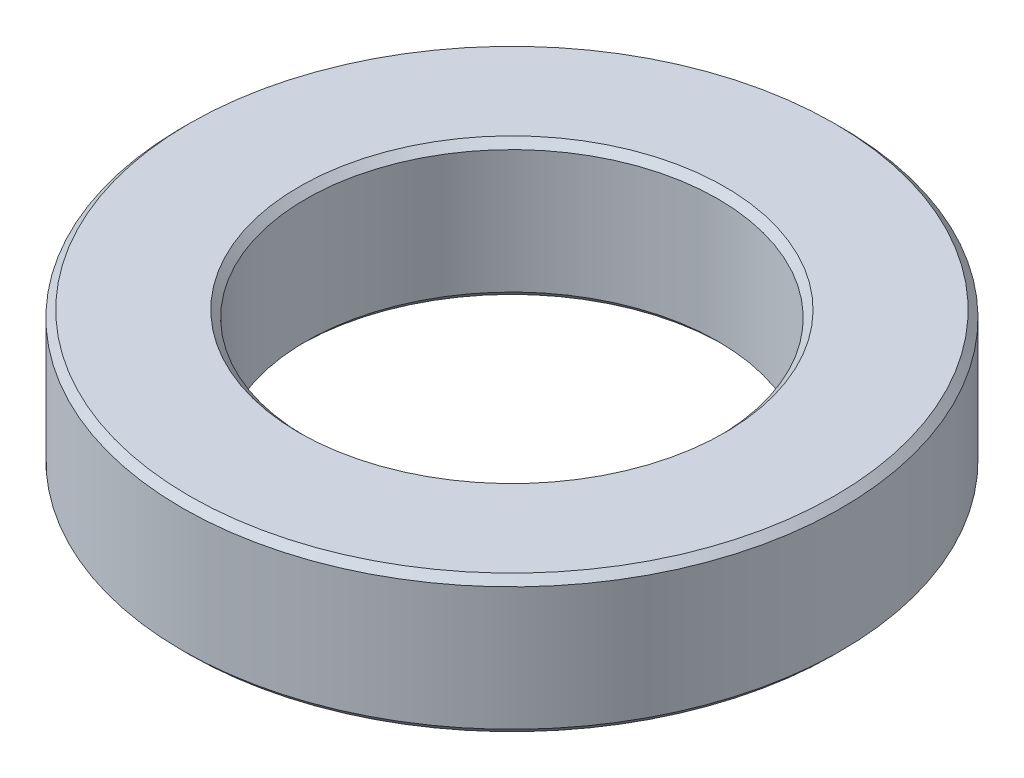
ISO-10303-21;
HEADER;
FILE_DESCRIPTION(('STEP AP214'),'2;1');
FILE_NAME('part.step','',(''),(''),'','','');
FILE_SCHEMA(('AUTOMOTIVE_DESIGN { 1 0 10303 214 1 1 1 1 }'));
ENDSEC;
DATA;
#1=APPLICATION_CONTEXT('core data for automotive mechanical design processes');
#2=APPLICATION_PROTOCOL_DEFINITION('international standard','automotive_design',2000,#1);
#3=PRODUCT_CONTEXT('',#1,'mechanical');
#4=PRODUCT('Part','Part','',(#3));
#5=PRODUCT_RELATED_PRODUCT_CATEGORY('part','',(#4));
#6=PRODUCT_DEFINITION_FORMATION('','',#4);
#7=PRODUCT_DEFINITION_CONTEXT('part definition',#1,'design');
#8=PRODUCT_DEFINITION('design','',#6,#7);
#9=PRODUCT_DEFINITION_SHAPE('','',#8);
#10=(LENGTH_UNIT() NAMED_UNIT(*) SI_UNIT(.MILLI.,.METRE.));
#11=(NAMED_UNIT(*) PLANE_ANGLE_UNIT() SI_UNIT($,.RADIAN.));
#12=(NAMED_UNIT(*) SI_UNIT($,.STERADIAN.) SOLID_ANGLE_UNIT());
#13=UNCERTAINTY_MEASURE_WITH_UNIT(LENGTH_MEASURE(1.E-05),#10,'distance_accuracy_value','');
#14=(GEOMETRIC_REPRESENTATION_CONTEXT(3) GLOBAL_UNCERTAINTY_ASSIGNED_CONTEXT((#13)) GLOBAL_UNIT_ASSIGNED_CONTEXT((#10,
#11,#12)) REPRESENTATION_CONTEXT('',''));
#15=CARTESIAN_POINT('',(0.,0.,0.));
#16=DIRECTION('',(0.,0.,1.));
#17=DIRECTION('',(1.,0.,0.));
#18=AXIS2_PLACEMENT_3D('',#15,#16,#17);
#19=CARTESIAN_POINT('',(0.,2.499999953,0.));
#20=DIRECTION('',(0.,1.,0.));
#21=DIRECTION('',(0.,0.,1.));
#22=AXIS2_PLACEMENT_3D('',#19,#20,#21);
#23=PLANE('',#22);
#24=CARTESIAN_POINT('',(0.,2.499999953,0.));
#25=DIRECTION('',(0.,1.,0.));
#26=DIRECTION('',(0.,0.,1.));
#27=AXIS2_PLACEMENT_3D('',#24,#25,#26);
#28=CIRCLE('',#27,7.75399998600001);
#29=CARTESIAN_POINT('',(0.,2.499999953,7.75399998600001));
#30=VERTEX_POINT('',#29);
#31=EDGE_CURVE('E10',#30,#30,#28,.F.);
#32=ORIENTED_EDGE('',*,*,#31,.T.);
#33=EDGE_LOOP('',(#32));
#34=FACE_BOUND('',#33,.T.);
#35=CARTESIAN_POINT('',(0.,2.499999953,0.));
#36=DIRECTION('',(0.,1.,0.));
#37=DIRECTION('',(0.,0.,1.));
#38=AXIS2_PLACEMENT_3D('',#35,#36,#37);
#39=CIRCLE('',#38,11.746000003);
#40=CARTESIAN_POINT('',(0.,2.499999953,11.746000003));
#41=VERTEX_POINT('',#40);
#42=EDGE_CURVE('E21',#41,#41,#39,.T.);
#43=ORIENTED_EDGE('',*,*,#42,.T.);
#44=EDGE_LOOP('',(#43));
#45=FACE_BOUND('',#44,.T.);
#46=ADVANCED_FACE('F14',(#34,#45),#23,.T.);
#47=CARTESIAN_POINT('',(0.,-2.499999953,0.));
#48=DIRECTION('',(0.,1.,0.));
#49=DIRECTION('',(0.,0.,1.));
#50=AXIS2_PLACEMENT_3D('',#47,#48,#49);
#51=PLANE('',#50);
#52=CARTESIAN_POINT('',(0.,-2.499999953,0.));
#53=DIRECTION('',(0.,1.,0.));
#54=DIRECTION('',(0.,0.,1.));
#55=AXIS2_PLACEMENT_3D('',#52,#53,#54);
#56=CIRCLE('',#55,7.753999986);
#57=CARTESIAN_POINT('',(0.,-2.499999953,7.753999986));
#58=VERTEX_POINT('',#57);
#59=EDGE_CURVE('E40',#58,#58,#56,.T.);
#60=ORIENTED_EDGE('',*,*,#59,.T.);
#61=EDGE_LOOP('',(#60));
#62=FACE_BOUND('',#61,.T.);
#63=CARTESIAN_POINT('',(0.,-2.499999953,0.));
#64=DIRECTION('',(0.,1.,0.));
#65=DIRECTION('',(0.,0.,1.));
#66=AXIS2_PLACEMENT_3D('',#63,#64,#65);
#67=CIRCLE('',#66,11.746000003);
#68=CARTESIAN_POINT('',(0.,-2.499999953,11.746000003));
#69=VERTEX_POINT('',#68);
#70=EDGE_CURVE('E43',#69,#69,#67,.F.);
#71=ORIENTED_EDGE('',*,*,#70,.T.);
#72=EDGE_LOOP('',(#71));
#73=FACE_BOUND('',#72,.T.);
#74=ADVANCED_FACE('F47',(#62,#73),#51,.F.);
#75=CARTESIAN_POINT('',(0.,2.499999953,0.));
#76=DIRECTION('',(0.,-1.,0.));
#77=DIRECTION('',(0.,0.,-1.));
#78=AXIS2_PLACEMENT_3D('',#75,#76,#77);
#79=CYLINDRICAL_SURFACE('',#78,12.000000003);
#80=CARTESIAN_POINT('',(0.,-2.24599995299999,0.));
#81=DIRECTION('',(0.,1.,0.));
#82=DIRECTION('',(0.,0.,1.));
#83=AXIS2_PLACEMENT_3D('',#80,#81,#82);
#84=CIRCLE('',#83,12.000000003);
#85=CARTESIAN_POINT('',(0.,-2.24599995299999,12.000000003));
#86=VERTEX_POINT('',#85);
#87=EDGE_CURVE('E25',#86,#86,#84,.T.);
#88=ORIENTED_EDGE('',*,*,#87,.T.);
#89=EDGE_LOOP('',(#88));
#90=FACE_BOUND('',#89,.T.);
#91=CARTESIAN_POINT('',(0.,2.245999953,0.));
#92=DIRECTION('',(0.,1.,0.));
#93=DIRECTION('',(0.,0.,1.));
#94=AXIS2_PLACEMENT_3D('',#91,#92,#93);
#95=CIRCLE('',#94,12.000000003);
#96=CARTESIAN_POINT('',(0.,2.245999953,12.000000003));
#97=VERTEX_POINT('',#96);
#98=EDGE_CURVE('E29',#97,#97,#95,.F.);
#99=ORIENTED_EDGE('',*,*,#98,.T.);
#100=EDGE_LOOP('',(#99));
#101=FACE_BOUND('',#100,.T.);
#102=ADVANCED_FACE('F57',(#90,#101),#79,.T.);
#103=CARTESIAN_POINT('',(0.,2.499999953,0.));
#104=DIRECTION('',(0.,-1.,0.));
#105=DIRECTION('',(0.,0.,-1.));
#106=AXIS2_PLACEMENT_3D('',#103,#104,#105);
#107=CYLINDRICAL_SURFACE('',#106,7.499999986);
#108=CARTESIAN_POINT('',(0.,-2.245999953,0.));
#109=DIRECTION('',(0.,1.,0.));
#110=DIRECTION('',(0.,0.,1.));
#111=AXIS2_PLACEMENT_3D('',#108,#109,#110);
#112=CIRCLE('',#111,7.499999986);
#113=CARTESIAN_POINT('',(0.,-2.245999953,7.499999986));
#114=VERTEX_POINT('',#113);
#115=EDGE_CURVE('E34',#114,#114,#112,.F.);
#116=ORIENTED_EDGE('',*,*,#115,.T.);
#117=EDGE_LOOP('',(#116));
#118=FACE_BOUND('',#117,.T.);
#119=CARTESIAN_POINT('',(0.,2.24599995299999,0.));
#120=DIRECTION('',(0.,1.,0.));
#121=DIRECTION('',(0.,0.,1.));
#122=AXIS2_PLACEMENT_3D('',#119,#120,#121);
#123=CIRCLE('',#122,7.499999986);
#124=CARTESIAN_POINT('',(0.,2.24599995299999,7.499999986));
#125=VERTEX_POINT('',#124);
#126=EDGE_CURVE('E37',#125,#125,#123,.T.);
#127=ORIENTED_EDGE('',*,*,#126,.T.);
#128=EDGE_LOOP('',(#127));
#129=FACE_BOUND('',#128,.T.);
#130=ADVANCED_FACE('F60',(#118,#129),#107,.F.);
#131=CARTESIAN_POINT('',(0.,-2.499999953,0.));
#132=DIRECTION('',(0.,-1.,0.));
#133=DIRECTION('',(0.,0.,-1.));
#134=AXIS2_PLACEMENT_3D('',#131,#132,#133);
#135=CONICAL_SURFACE('',#134,7.753999986,0.785398163397445);
#136=ORIENTED_EDGE('',*,*,#115,.F.);
#137=EDGE_LOOP('',(#136));
#138=FACE_BOUND('',#137,.T.);
#139=ORIENTED_EDGE('',*,*,#59,.F.);
#140=EDGE_LOOP('',(#139));
#141=FACE_BOUND('',#140,.T.);
#142=ADVANCED_FACE('F53',(#138,#141),#135,.F.);
#143=CARTESIAN_POINT('',(0.,-2.24599995299999,0.));
#144=DIRECTION('',(0.,1.,0.));
#145=DIRECTION('',(0.,0.,1.));
#146=AXIS2_PLACEMENT_3D('',#143,#144,#145);
#147=CONICAL_SURFACE('',#146,12.000000003,0.785398163397448);
#148=ORIENTED_EDGE('',*,*,#70,.F.);
#149=EDGE_LOOP('',(#148));
#150=FACE_BOUND('',#149,.T.);
#151=ORIENTED_EDGE('',*,*,#87,.F.);
#152=EDGE_LOOP('',(#151));
#153=FACE_BOUND('',#152,.T.);
#154=ADVANCED_FACE('F49',(#150,#153),#147,.T.);
#155=CARTESIAN_POINT('',(0.,2.24599995299999,0.));
#156=DIRECTION('',(0.,1.,0.));
#157=DIRECTION('',(0.,0.,1.));
#158=AXIS2_PLACEMENT_3D('',#155,#156,#157);
#159=CONICAL_SURFACE('',#158,7.499999986,0.785398163397452);
#160=ORIENTED_EDGE('',*,*,#31,.F.);
#161=EDGE_LOOP('',(#160));
#162=FACE_BOUND('',#161,.T.);
#163=ORIENTED_EDGE('',*,*,#126,.F.);
#164=EDGE_LOOP('',(#163));
#165=FACE_BOUND('',#164,.T.);
#166=ADVANCED_FACE('F52',(#162,#165),#159,.F.);
#167=CARTESIAN_POINT('',(0.,2.499999953,0.));
#168=DIRECTION('',(0.,-1.,0.));
#169=DIRECTION('',(0.,0.,-1.));
#170=AXIS2_PLACEMENT_3D('',#167,#168,#169);
#171=CONICAL_SURFACE('',#170,11.746000003,0.785398163397435);
#172=ORIENTED_EDGE('',*,*,#98,.F.);
#173=EDGE_LOOP('',(#172));
#174=FACE_BOUND('',#173,.T.);
#175=ORIENTED_EDGE('',*,*,#42,.F.);
#176=EDGE_LOOP('',(#175));
#177=FACE_BOUND('',#176,.T.);
#178=ADVANCED_FACE('F16',(#174,#177),#171,.T.);
#179=CLOSED_SHELL('',(#46,#74,#102,#130,#142,#154,#166,#178));
#180=MANIFOLD_SOLID_BREP('B1',#179);
#181=ADVANCED_BREP_SHAPE_REPRESENTATION('',(#18,#180),#14);
#182=SHAPE_DEFINITION_REPRESENTATION(#9,#181);
ENDSEC;
END-ISO-10303-21;
